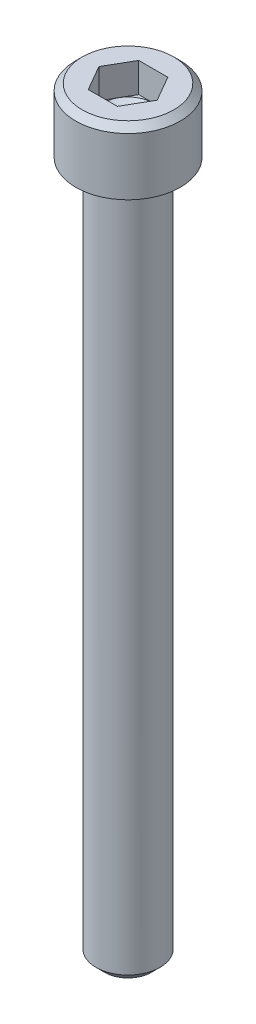
ISO-10303-21;
HEADER;
FILE_DESCRIPTION(('STEP AP214'),'2;1');
FILE_NAME('part.step','',(''),(''),'','','');
FILE_SCHEMA(('AUTOMOTIVE_DESIGN { 1 0 10303 214 1 1 1 1 }'));
ENDSEC;
DATA;
#1=APPLICATION_CONTEXT('core data for automotive mechanical design processes');
#2=APPLICATION_PROTOCOL_DEFINITION('international standard','automotive_design',2000,#1);
#3=PRODUCT_CONTEXT('',#1,'mechanical');
#4=PRODUCT('Part','Part','',(#3));
#5=PRODUCT_RELATED_PRODUCT_CATEGORY('part','',(#4));
#6=PRODUCT_DEFINITION_FORMATION('','',#4);
#7=PRODUCT_DEFINITION_CONTEXT('part definition',#1,'design');
#8=PRODUCT_DEFINITION('design','',#6,#7);
#9=PRODUCT_DEFINITION_SHAPE('','',#8);
#10=(LENGTH_UNIT() NAMED_UNIT(*) SI_UNIT(.MILLI.,.METRE.));
#11=(NAMED_UNIT(*) PLANE_ANGLE_UNIT() SI_UNIT($,.RADIAN.));
#12=(NAMED_UNIT(*) SI_UNIT($,.STERADIAN.) SOLID_ANGLE_UNIT());
#13=UNCERTAINTY_MEASURE_WITH_UNIT(LENGTH_MEASURE(1.E-05),#10,'distance_accuracy_value','');
#14=(GEOMETRIC_REPRESENTATION_CONTEXT(3) GLOBAL_UNCERTAINTY_ASSIGNED_CONTEXT((#13)) GLOBAL_UNIT_ASSIGNED_CONTEXT((#10,
#11,#12)) REPRESENTATION_CONTEXT('',''));
#15=CARTESIAN_POINT('',(0.,0.,0.));
#16=DIRECTION('',(0.,0.,1.));
#17=DIRECTION('',(1.,0.,0.));
#18=AXIS2_PLACEMENT_3D('',#15,#16,#17);
#19=CARTESIAN_POINT('',(0.,1.87959999988152,0.));
#20=DIRECTION('',(0.,1.,0.));
#21=DIRECTION('',(0.,0.,1.));
#22=AXIS2_PLACEMENT_3D('',#19,#20,#21);
#23=CONICAL_SURFACE('',#22,1.38429999981327,1.04719755105418);
#24=CARTESIAN_POINT('',(0.,1.08037402230821,-1.70530256582424E-10));
#25=VERTEX_POINT('',#24);
#26=VERTEX_LOOP('',#25);
#27=FACE_BOUND('',#26,.T.);
#28=CARTESIAN_POINT('',(0.,1.87959999997998,0.));
#29=DIRECTION('',(0.,1.,0.));
#30=DIRECTION('',(0.,0.,1.));
#31=AXIS2_PLACEMENT_3D('',#28,#29,#30);
#32=CIRCLE('',#31,1.3842999999838);
#33=CARTESIAN_POINT('',(-1.19883896645178,1.87959999998999,-0.692149999995953));
#34=VERTEX_POINT('',#33);
#35=CARTESIAN_POINT('',(0.,1.87959999998999,-1.3842999999919));
#36=VERTEX_POINT('',#35);
#37=EDGE_CURVE('E150',#34,#36,#32,.F.);
#38=ORIENTED_EDGE('',*,*,#37,.F.);
#39=CARTESIAN_POINT('',(0.,1.87959999997998,0.));
#40=DIRECTION('',(0.,1.,0.));
#41=DIRECTION('',(0.,0.,1.));
#42=AXIS2_PLACEMENT_3D('',#39,#40,#41);
#43=CIRCLE('',#42,1.3842999999838);
#44=CARTESIAN_POINT('',(-1.19883896645178,1.87959999998999,0.692149999995946));
#45=VERTEX_POINT('',#44);
#46=EDGE_CURVE('E97',#45,#34,#43,.F.);
#47=ORIENTED_EDGE('',*,*,#46,.F.);
#48=CARTESIAN_POINT('',(0.,1.87959999997998,0.));
#49=DIRECTION('',(0.,1.,0.));
#50=DIRECTION('',(0.,0.,1.));
#51=AXIS2_PLACEMENT_3D('',#48,#49,#50);
#52=CIRCLE('',#51,1.3842999999838);
#53=CARTESIAN_POINT('',(0.,1.87959999998999,1.3842999999919));
#54=VERTEX_POINT('',#53);
#55=EDGE_CURVE('E93',#54,#45,#52,.F.);
#56=ORIENTED_EDGE('',*,*,#55,.F.);
#57=CARTESIAN_POINT('',(0.,1.87959999997998,0.));
#58=DIRECTION('',(0.,1.,0.));
#59=DIRECTION('',(0.,0.,1.));
#60=AXIS2_PLACEMENT_3D('',#57,#58,#59);
#61=CIRCLE('',#60,1.3842999999838);
#62=CARTESIAN_POINT('',(1.19883896645178,1.87959999998999,0.692149999995948));
#63=VERTEX_POINT('',#62);
#64=EDGE_CURVE('E91',#63,#54,#61,.F.);
#65=ORIENTED_EDGE('',*,*,#64,.F.);
#66=CARTESIAN_POINT('',(0.,1.87959999997998,0.));
#67=DIRECTION('',(0.,1.,0.));
#68=DIRECTION('',(0.,0.,1.));
#69=AXIS2_PLACEMENT_3D('',#66,#67,#68);
#70=CIRCLE('',#69,1.3842999999838);
#71=CARTESIAN_POINT('',(1.19883896645178,1.87959999998999,-0.692149999995947));
#72=VERTEX_POINT('',#71);
#73=EDGE_CURVE('E21',#72,#63,#70,.F.);
#74=ORIENTED_EDGE('',*,*,#73,.F.);
#75=CARTESIAN_POINT('',(0.,1.87959999997998,0.));
#76=DIRECTION('',(0.,1.,0.));
#77=DIRECTION('',(0.,0.,1.));
#78=AXIS2_PLACEMENT_3D('',#75,#76,#77);
#79=CIRCLE('',#78,1.3842999999838);
#80=EDGE_CURVE('E108',#36,#72,#79,.F.);
#81=ORIENTED_EDGE('',*,*,#80,.F.);
#82=EDGE_LOOP('',(#38,#47,#56,#65,#74,#81));
#83=FACE_BOUND('',#82,.T.);
#84=ADVANCED_FACE('F18',(#27,#83),#23,.F.);
#85=CARTESIAN_POINT('',(0.,1.8796,0.));
#86=DIRECTION('',(0.,1.,0.));
#87=DIRECTION('',(0.,0.,1.));
#88=AXIS2_PLACEMENT_3D('',#85,#86,#87);
#89=PLANE('',#88);
#90=DIRECTION('',(0.500000000000001,0.,-0.866025403784438));
#91=VECTOR('',#90,1.);
#92=CARTESIAN_POINT('',(0.799225977639198,1.8796,1.3843));
#93=LINE('',#92,#91);
#94=CARTESIAN_POINT('',(1.5984519552784,1.8796,0.));
#95=VERTEX_POINT('',#94);
#96=EDGE_CURVE('E103',#63,#95,#93,.T.);
#97=ORIENTED_EDGE('',*,*,#96,.T.);
#98=DIRECTION('',(-0.499999999999999,0.,-0.866025403784439));
#99=VECTOR('',#98,1.);
#100=CARTESIAN_POINT('',(1.5984519552784,1.8796,0.));
#101=LINE('',#100,#99);
#102=EDGE_CURVE('E106',#95,#72,#101,.T.);
#103=ORIENTED_EDGE('',*,*,#102,.T.);
#104=ORIENTED_EDGE('',*,*,#73,.T.);
#105=EDGE_LOOP('',(#97,#103,#104));
#106=FACE_BOUND('',#105,.T.);
#107=ADVANCED_FACE('F101',(#106),#89,.T.);
#108=CARTESIAN_POINT('',(0.,1.8796,0.));
#109=DIRECTION('',(0.,1.,0.));
#110=DIRECTION('',(0.,0.,1.));
#111=AXIS2_PLACEMENT_3D('',#108,#109,#110);
#112=PLANE('',#111);
#113=DIRECTION('',(-0.499999999999999,0.,-0.866025403784439));
#114=VECTOR('',#113,1.);
#115=CARTESIAN_POINT('',(1.5984519552784,1.8796,0.));
#116=LINE('',#115,#114);
#117=CARTESIAN_POINT('',(0.799225977639201,1.8796,-1.3843));
#118=VERTEX_POINT('',#117);
#119=EDGE_CURVE('E117',#72,#118,#116,.T.);
#120=ORIENTED_EDGE('',*,*,#119,.T.);
#121=DIRECTION('',(-1.,0.,0.));
#122=VECTOR('',#121,1.);
#123=CARTESIAN_POINT('',(0.799225977639201,1.8796,-1.3843));
#124=LINE('',#123,#122);
#125=EDGE_CURVE('E157',#118,#36,#124,.T.);
#126=ORIENTED_EDGE('',*,*,#125,.T.);
#127=ORIENTED_EDGE('',*,*,#80,.T.);
#128=EDGE_LOOP('',(#120,#126,#127));
#129=FACE_BOUND('',#128,.T.);
#130=ADVANCED_FACE('F154',(#129),#112,.T.);
#131=CARTESIAN_POINT('',(0.,1.8796,0.));
#132=DIRECTION('',(0.,1.,0.));
#133=DIRECTION('',(0.,0.,1.));
#134=AXIS2_PLACEMENT_3D('',#131,#132,#133);
#135=PLANE('',#134);
#136=DIRECTION('',(-1.,0.,0.));
#137=VECTOR('',#136,1.);
#138=CARTESIAN_POINT('',(0.799225977639201,1.8796,-1.3843));
#139=LINE('',#138,#137);
#140=CARTESIAN_POINT('',(-0.799225977639195,1.8796,-1.3843));
#141=VERTEX_POINT('',#140);
#142=EDGE_CURVE('E162',#36,#141,#139,.T.);
#143=ORIENTED_EDGE('',*,*,#142,.T.);
#144=DIRECTION('',(-0.5,0.,0.866025403784438));
#145=VECTOR('',#144,1.);
#146=CARTESIAN_POINT('',(-0.799225977639195,1.8796,-1.3843));
#147=LINE('',#146,#145);
#148=EDGE_CURVE('E165',#141,#34,#147,.T.);
#149=ORIENTED_EDGE('',*,*,#148,.T.);
#150=ORIENTED_EDGE('',*,*,#37,.T.);
#151=EDGE_LOOP('',(#143,#149,#150));
#152=FACE_BOUND('',#151,.T.);
#153=ADVANCED_FACE('F161',(#152),#135,.T.);
#154=CARTESIAN_POINT('',(0.,1.8796,0.));
#155=DIRECTION('',(0.,1.,0.));
#156=DIRECTION('',(0.,0.,1.));
#157=AXIS2_PLACEMENT_3D('',#154,#155,#156);
#158=PLANE('',#157);
#159=DIRECTION('',(-0.5,0.,0.866025403784438));
#160=VECTOR('',#159,1.);
#161=CARTESIAN_POINT('',(-0.799225977639195,1.8796,-1.3843));
#162=LINE('',#161,#160);
#163=CARTESIAN_POINT('',(-1.5984519552784,1.8796,0.));
#164=VERTEX_POINT('',#163);
#165=EDGE_CURVE('E173',#34,#164,#162,.T.);
#166=ORIENTED_EDGE('',*,*,#165,.T.);
#167=DIRECTION('',(0.5,0.,0.866025403784439));
#168=VECTOR('',#167,1.);
#169=CARTESIAN_POINT('',(-1.5984519552784,1.8796,0.));
#170=LINE('',#169,#168);
#171=EDGE_CURVE('E232',#164,#45,#170,.T.);
#172=ORIENTED_EDGE('',*,*,#171,.T.);
#173=ORIENTED_EDGE('',*,*,#46,.T.);
#174=EDGE_LOOP('',(#166,#172,#173));
#175=FACE_BOUND('',#174,.T.);
#176=ADVANCED_FACE('F337',(#175),#158,.T.);
#177=CARTESIAN_POINT('',(0.,1.8796,0.));
#178=DIRECTION('',(0.,1.,0.));
#179=DIRECTION('',(0.,0.,1.));
#180=AXIS2_PLACEMENT_3D('',#177,#178,#179);
#181=PLANE('',#180);
#182=DIRECTION('',(1.,0.,0.));
#183=VECTOR('',#182,1.);
#184=CARTESIAN_POINT('',(-0.799225977639198,1.8796,1.3843));
#185=LINE('',#184,#183);
#186=CARTESIAN_POINT('',(0.799225977639198,1.8796,1.3843));
#187=VERTEX_POINT('',#186);
#188=EDGE_CURVE('E113',#54,#187,#185,.T.);
#189=ORIENTED_EDGE('',*,*,#188,.T.);
#190=DIRECTION('',(0.500000000000001,0.,-0.866025403784438));
#191=VECTOR('',#190,1.);
#192=CARTESIAN_POINT('',(0.799225977639198,1.8796,1.3843));
#193=LINE('',#192,#191);
#194=EDGE_CURVE('E110',#187,#63,#193,.T.);
#195=ORIENTED_EDGE('',*,*,#194,.T.);
#196=ORIENTED_EDGE('',*,*,#64,.T.);
#197=EDGE_LOOP('',(#189,#195,#196));
#198=FACE_BOUND('',#197,.T.);
#199=ADVANCED_FACE('F111',(#198),#181,.T.);
#200=CARTESIAN_POINT('',(0.,1.8796,0.));
#201=DIRECTION('',(0.,1.,0.));
#202=DIRECTION('',(0.,0.,1.));
#203=AXIS2_PLACEMENT_3D('',#200,#201,#202);
#204=PLANE('',#203);
#205=DIRECTION('',(0.5,0.,0.866025403784439));
#206=VECTOR('',#205,1.);
#207=CARTESIAN_POINT('',(-1.5984519552784,1.8796,0.));
#208=LINE('',#207,#206);
#209=CARTESIAN_POINT('',(-0.799225977639199,1.8796,1.3843));
#210=VERTEX_POINT('',#209);
#211=EDGE_CURVE('E169',#45,#210,#208,.T.);
#212=ORIENTED_EDGE('',*,*,#211,.T.);
#213=DIRECTION('',(1.,0.,0.));
#214=VECTOR('',#213,1.);
#215=CARTESIAN_POINT('',(-0.799225977639198,1.8796,1.3843));
#216=LINE('',#215,#214);
#217=EDGE_CURVE('E133',#210,#54,#216,.T.);
#218=ORIENTED_EDGE('',*,*,#217,.T.);
#219=ORIENTED_EDGE('',*,*,#55,.T.);
#220=EDGE_LOOP('',(#212,#218,#219));
#221=FACE_BOUND('',#220,.T.);
#222=ADVANCED_FACE('F331',(#221),#204,.T.);
#223=CARTESIAN_POINT('',(0.799225977639198,3.5052,1.3843));
#224=DIRECTION('',(0.866025403784438,0.,0.500000000000001));
#225=DIRECTION('',(0.500000000000001,0.,-0.866025403784438));
#226=AXIS2_PLACEMENT_3D('',#223,#224,#225);
#227=PLANE('',#226);
#228=DIRECTION('',(0.,1.,0.));
#229=VECTOR('',#228,1.);
#230=CARTESIAN_POINT('',(0.799225977639198,3.5052,1.3843));
#231=LINE('',#230,#229);
#232=CARTESIAN_POINT('',(0.799225977639198,3.5052,1.3843));
#233=VERTEX_POINT('',#232);
#234=EDGE_CURVE('E240',#187,#233,#231,.T.);
#235=ORIENTED_EDGE('',*,*,#234,.T.);
#236=DIRECTION('',(0.500000000000002,0.,-0.866025403784437));
#237=VECTOR('',#236,1.);
#238=CARTESIAN_POINT('',(0.799225977639198,3.5052,1.3843));
#239=LINE('',#238,#237);
#240=CARTESIAN_POINT('',(1.5984519552784,3.5052,0.));
#241=VERTEX_POINT('',#240);
#242=EDGE_CURVE('E130',#233,#241,#239,.T.);
#243=ORIENTED_EDGE('',*,*,#242,.T.);
#244=DIRECTION('',(0.,1.,0.));
#245=VECTOR('',#244,1.);
#246=CARTESIAN_POINT('',(1.5984519552784,3.5052,0.));
#247=LINE('',#246,#245);
#248=EDGE_CURVE('E121',#241,#95,#247,.F.);
#249=ORIENTED_EDGE('',*,*,#248,.T.);
#250=ORIENTED_EDGE('',*,*,#96,.F.);
#251=ORIENTED_EDGE('',*,*,#194,.F.);
#252=EDGE_LOOP('',(#235,#243,#249,#250,#251));
#253=FACE_BOUND('',#252,.T.);
#254=ADVANCED_FACE('F119',(#253),#227,.F.);
#255=CARTESIAN_POINT('',(1.5984519552784,3.5052,0.));
#256=DIRECTION('',(0.866025403784439,0.,-0.499999999999999));
#257=DIRECTION('',(-0.499999999999999,0.,-0.866025403784439));
#258=AXIS2_PLACEMENT_3D('',#255,#256,#257);
#259=PLANE('',#258);
#260=ORIENTED_EDGE('',*,*,#248,.F.);
#261=DIRECTION('',(-0.5,0.,-0.866025403784439));
#262=VECTOR('',#261,1.);
#263=CARTESIAN_POINT('',(1.5984519552784,3.5052,0.));
#264=LINE('',#263,#262);
#265=CARTESIAN_POINT('',(0.799225977639201,3.5052,-1.3843));
#266=VERTEX_POINT('',#265);
#267=EDGE_CURVE('E132',#241,#266,#264,.T.);
#268=ORIENTED_EDGE('',*,*,#267,.T.);
#269=DIRECTION('',(0.,1.,0.));
#270=VECTOR('',#269,1.);
#271=CARTESIAN_POINT('',(0.799225977639201,3.5052,-1.3843));
#272=LINE('',#271,#270);
#273=EDGE_CURVE('E181',#266,#118,#272,.F.);
#274=ORIENTED_EDGE('',*,*,#273,.T.);
#275=ORIENTED_EDGE('',*,*,#119,.F.);
#276=ORIENTED_EDGE('',*,*,#102,.F.);
#277=EDGE_LOOP('',(#260,#268,#274,#275,#276));
#278=FACE_BOUND('',#277,.T.);
#279=ADVANCED_FACE('F220',(#278),#259,.F.);
#280=CARTESIAN_POINT('',(0.799225977639201,3.5052,-1.3843));
#281=DIRECTION('',(0.,0.,-1.));
#282=DIRECTION('',(-1.,0.,0.));
#283=AXIS2_PLACEMENT_3D('',#280,#281,#282);
#284=PLANE('',#283);
#285=ORIENTED_EDGE('',*,*,#273,.F.);
#286=DIRECTION('',(1.,0.,0.));
#287=VECTOR('',#286,1.);
#288=CARTESIAN_POINT('',(0.,3.5052,-1.3843));
#289=LINE('',#288,#287);
#290=CARTESIAN_POINT('',(-0.799225977639195,3.5052,-1.3843));
#291=VERTEX_POINT('',#290);
#292=EDGE_CURVE('E191',#266,#291,#289,.F.);
#293=ORIENTED_EDGE('',*,*,#292,.T.);
#294=DIRECTION('',(0.,1.,0.));
#295=VECTOR('',#294,1.);
#296=CARTESIAN_POINT('',(-0.799225977639195,3.5052,-1.3843));
#297=LINE('',#296,#295);
#298=EDGE_CURVE('E170',#291,#141,#297,.F.);
#299=ORIENTED_EDGE('',*,*,#298,.T.);
#300=ORIENTED_EDGE('',*,*,#142,.F.);
#301=ORIENTED_EDGE('',*,*,#125,.F.);
#302=EDGE_LOOP('',(#285,#293,#299,#300,#301));
#303=FACE_BOUND('',#302,.T.);
#304=ADVANCED_FACE('F225',(#303),#284,.F.);
#305=CARTESIAN_POINT('',(-0.799225977639195,3.5052,-1.3843));
#306=DIRECTION('',(-0.866025403784438,0.,-0.5));
#307=DIRECTION('',(-0.5,0.,0.866025403784438));
#308=AXIS2_PLACEMENT_3D('',#305,#306,#307);
#309=PLANE('',#308);
#310=ORIENTED_EDGE('',*,*,#298,.F.);
#311=DIRECTION('',(-0.500000000000003,0.,0.866025403784437));
#312=VECTOR('',#311,1.);
#313=CARTESIAN_POINT('',(-0.799225977639195,3.5052,-1.3843));
#314=LINE('',#313,#312);
#315=CARTESIAN_POINT('',(-1.5984519552784,3.5052,0.));
#316=VERTEX_POINT('',#315);
#317=EDGE_CURVE('E189',#291,#316,#314,.T.);
#318=ORIENTED_EDGE('',*,*,#317,.T.);
#319=DIRECTION('',(0.,1.,0.));
#320=VECTOR('',#319,1.);
#321=CARTESIAN_POINT('',(-1.5984519552784,3.5052,0.));
#322=LINE('',#321,#320);
#323=EDGE_CURVE('E175',#316,#164,#322,.F.);
#324=ORIENTED_EDGE('',*,*,#323,.T.);
#325=ORIENTED_EDGE('',*,*,#165,.F.);
#326=ORIENTED_EDGE('',*,*,#148,.F.);
#327=EDGE_LOOP('',(#310,#318,#324,#325,#326));
#328=FACE_BOUND('',#327,.T.);
#329=ADVANCED_FACE('F174',(#328),#309,.F.);
#330=CARTESIAN_POINT('',(-1.5984519552784,3.5052,0.));
#331=DIRECTION('',(-0.866025403784439,0.,0.5));
#332=DIRECTION('',(0.5,0.,0.866025403784439));
#333=AXIS2_PLACEMENT_3D('',#330,#331,#332);
#334=PLANE('',#333);
#335=ORIENTED_EDGE('',*,*,#323,.F.);
#336=DIRECTION('',(0.500000000000001,0.,0.866025403784438));
#337=VECTOR('',#336,1.);
#338=CARTESIAN_POINT('',(-1.5984519552784,3.5052,0.));
#339=LINE('',#338,#337);
#340=CARTESIAN_POINT('',(-0.799225977639198,3.5052,1.3843));
#341=VERTEX_POINT('',#340);
#342=EDGE_CURVE('E36',#316,#341,#339,.T.);
#343=ORIENTED_EDGE('',*,*,#342,.T.);
#344=DIRECTION('',(0.,1.,0.));
#345=VECTOR('',#344,1.);
#346=CARTESIAN_POINT('',(-0.799225977639198,3.5052,1.3843));
#347=LINE('',#346,#345);
#348=EDGE_CURVE('E242',#341,#210,#347,.F.);
#349=ORIENTED_EDGE('',*,*,#348,.T.);
#350=ORIENTED_EDGE('',*,*,#211,.F.);
#351=ORIENTED_EDGE('',*,*,#171,.F.);
#352=EDGE_LOOP('',(#335,#343,#349,#350,#351));
#353=FACE_BOUND('',#352,.T.);
#354=ADVANCED_FACE('F230',(#353),#334,.F.);
#355=CARTESIAN_POINT('',(-0.799225977639198,3.5052,1.3843));
#356=DIRECTION('',(0.,0.,1.));
#357=DIRECTION('',(1.,0.,0.));
#358=AXIS2_PLACEMENT_3D('',#355,#356,#357);
#359=PLANE('',#358);
#360=ORIENTED_EDGE('',*,*,#348,.F.);
#361=DIRECTION('',(1.,0.,0.));
#362=VECTOR('',#361,1.);
#363=CARTESIAN_POINT('',(0.,3.5052,1.3843));
#364=LINE('',#363,#362);
#365=EDGE_CURVE('E146',#341,#233,#364,.T.);
#366=ORIENTED_EDGE('',*,*,#365,.T.);
#367=ORIENTED_EDGE('',*,*,#234,.F.);
#368=ORIENTED_EDGE('',*,*,#188,.F.);
#369=ORIENTED_EDGE('',*,*,#217,.F.);
#370=EDGE_LOOP('',(#360,#366,#367,#368,#369));
#371=FACE_BOUND('',#370,.T.);
#372=ADVANCED_FACE('F317',(#371),#359,.F.);
#373=CARTESIAN_POINT('',(0.,3.5052,0.));
#374=DIRECTION('',(0.,-1.,0.));
#375=DIRECTION('',(0.,0.,-1.));
#376=AXIS2_PLACEMENT_3D('',#373,#374,#375);
#377=PLANE('',#376);
#378=ORIENTED_EDGE('',*,*,#342,.F.);
#379=ORIENTED_EDGE('',*,*,#317,.F.);
#380=ORIENTED_EDGE('',*,*,#292,.F.);
#381=ORIENTED_EDGE('',*,*,#267,.F.);
#382=ORIENTED_EDGE('',*,*,#242,.F.);
#383=ORIENTED_EDGE('',*,*,#365,.F.);
#384=EDGE_LOOP('',(#378,#379,#380,#381,#382,#383));
#385=FACE_BOUND('',#384,.T.);
#386=CARTESIAN_POINT('',(0.,3.50519999994958,0.));
#387=DIRECTION('',(0.,-1.,0.));
#388=DIRECTION('',(0.,0.,-1.));
#389=AXIS2_PLACEMENT_3D('',#386,#387,#388);
#390=CIRCLE('',#389,2.51460000004045);
#391=CARTESIAN_POINT('',(0.,3.50519999994958,-2.51460000004045));
#392=VERTEX_POINT('',#391);
#393=EDGE_CURVE('E144',#392,#392,#390,.T.);
#394=ORIENTED_EDGE('',*,*,#393,.F.);
#395=EDGE_LOOP('',(#394));
#396=FACE_BOUND('',#395,.T.);
#397=ADVANCED_FACE('F227',(#385,#396),#377,.F.);
#398=CARTESIAN_POINT('',(0.,3.14960000002884,0.));
#399=DIRECTION('',(0.,-1.,0.));
#400=DIRECTION('',(0.,0.,-1.));
#401=AXIS2_PLACEMENT_3D('',#398,#399,#400);
#402=CONICAL_SURFACE('',#401,2.87020000001803,0.785398163477374);
#403=CARTESIAN_POINT('',(0.,3.1496,0.));
#404=DIRECTION('',(0.,-1.,0.));
#405=DIRECTION('',(0.,0.,-1.));
#406=AXIS2_PLACEMENT_3D('',#403,#404,#405);
#407=CIRCLE('',#406,2.8702);
#408=CARTESIAN_POINT('',(0.,3.1496,-2.8702));
#409=VERTEX_POINT('',#408);
#410=EDGE_CURVE('E143',#409,#409,#407,.T.);
#411=ORIENTED_EDGE('',*,*,#410,.F.);
#412=EDGE_LOOP('',(#411));
#413=FACE_BOUND('',#412,.T.);
#414=ORIENTED_EDGE('',*,*,#393,.T.);
#415=EDGE_LOOP('',(#414));
#416=FACE_BOUND('',#415,.T.);
#417=ADVANCED_FACE('F310',(#413,#416),#402,.T.);
#418=CARTESIAN_POINT('',(0.,5.58546,0.));
#419=DIRECTION('',(0.,-1.,0.));
#420=DIRECTION('',(0.,0.,-1.));
#421=AXIS2_PLACEMENT_3D('',#418,#419,#420);
#422=CYLINDRICAL_SURFACE('',#421,2.8702);
#423=CARTESIAN_POINT('',(0.,0.,0.));
#424=DIRECTION('',(0.,-1.,0.));
#425=DIRECTION('',(0.,0.,-1.));
#426=AXIS2_PLACEMENT_3D('',#423,#424,#425);
#427=CIRCLE('',#426,2.8702);
#428=CARTESIAN_POINT('',(0.,0.,-2.8702));
#429=VERTEX_POINT('',#428);
#430=EDGE_CURVE('E140',#429,#429,#427,.T.);
#431=ORIENTED_EDGE('',*,*,#430,.F.);
#432=EDGE_LOOP('',(#431));
#433=FACE_BOUND('',#432,.T.);
#434=ORIENTED_EDGE('',*,*,#410,.T.);
#435=EDGE_LOOP('',(#434));
#436=FACE_BOUND('',#435,.T.);
#437=ADVANCED_FACE('F307',(#433,#436),#422,.T.);
#438=CARTESIAN_POINT('',(0.,0.,0.));
#439=DIRECTION('',(0.,-1.,0.));
#440=DIRECTION('',(0.,0.,-1.));
#441=AXIS2_PLACEMENT_3D('',#438,#439,#440);
#442=PLANE('',#441);
#443=CARTESIAN_POINT('',(0.,0.,0.));
#444=DIRECTION('',(0.,-1.,0.));
#445=DIRECTION('',(-1.,0.,-3.20523991131182E-11));
#446=AXIS2_PLACEMENT_3D('',#443,#444,#445);
#447=CIRCLE('',#446,2.0066);
#448=CARTESIAN_POINT('',(-2.0066,0.,-6.43163440603831E-11));
#449=VERTEX_POINT('',#448);
#450=EDGE_CURVE('E139',#449,#449,#447,.F.);
#451=ORIENTED_EDGE('',*,*,#450,.T.);
#452=EDGE_LOOP('',(#451));
#453=FACE_BOUND('',#452,.T.);
#454=ORIENTED_EDGE('',*,*,#430,.T.);
#455=EDGE_LOOP('',(#454));
#456=FACE_BOUND('',#455,.T.);
#457=ADVANCED_FACE('F298',(#453,#456),#442,.T.);
#458=CARTESIAN_POINT('',(0.,-38.1,0.));
#459=DIRECTION('',(0.,-1.,0.));
#460=DIRECTION('',(0.,0.,-1.));
#461=AXIS2_PLACEMENT_3D('',#458,#459,#460);
#462=PLANE('',#461);
#463=CARTESIAN_POINT('',(0.,-38.0999999999858,0.));
#464=DIRECTION('',(0.,1.,0.));
#465=DIRECTION('',(0.,0.,1.));
#466=AXIS2_PLACEMENT_3D('',#463,#464,#465);
#467=CIRCLE('',#466,1.28016000002162);
#468=CARTESIAN_POINT('',(0.,-38.0999999999858,1.28016000002162));
#469=VERTEX_POINT('',#468);
#470=EDGE_CURVE('E136',#469,#469,#467,.T.);
#471=ORIENTED_EDGE('',*,*,#470,.F.);
#472=EDGE_LOOP('',(#471));
#473=FACE_BOUND('',#472,.T.);
#474=ADVANCED_FACE('F285',(#473),#462,.T.);
#475=CARTESIAN_POINT('',(0.,-0.254,0.));
#476=DIRECTION('',(0.,-1.,0.));
#477=DIRECTION('',(0.,0.,-1.));
#478=AXIS2_PLACEMENT_3D('',#475,#476,#477);
#479=TOROIDAL_SURFACE('',#478,2.0066,0.254);
#480=CARTESIAN_POINT('',(0.,-0.254,0.));
#481=DIRECTION('',(0.,-1.,0.));
#482=DIRECTION('',(0.,0.,-1.));
#483=AXIS2_PLACEMENT_3D('',#480,#481,#482);
#484=CIRCLE('',#483,1.7526);
#485=CARTESIAN_POINT('',(0.,-0.254,-1.7526));
#486=VERTEX_POINT('',#485);
#487=EDGE_CURVE('E27',#486,#486,#484,.T.);
#488=ORIENTED_EDGE('',*,*,#487,.F.);
#489=EDGE_LOOP('',(#488));
#490=FACE_BOUND('',#489,.T.);
#491=ORIENTED_EDGE('',*,*,#450,.F.);
#492=EDGE_LOOP('',(#491));
#493=FACE_BOUND('',#492,.T.);
#494=ADVANCED_FACE('F273',(#490,#493),#479,.F.);
#495=CARTESIAN_POINT('',(0.,-37.6275600000326,0.));
#496=DIRECTION('',(0.,1.,0.));
#497=DIRECTION('',(0.,0.,1.));
#498=AXIS2_PLACEMENT_3D('',#495,#496,#497);
#499=CONICAL_SURFACE('',#498,1.75259999997479,0.785398163397448);
#500=ORIENTED_EDGE('',*,*,#470,.T.);
#501=EDGE_LOOP('',(#500));
#502=FACE_BOUND('',#501,.T.);
#503=CARTESIAN_POINT('',(0.,-37.62756,0.));
#504=DIRECTION('',(0.,-1.,0.));
#505=DIRECTION('',(0.,0.,-1.));
#506=AXIS2_PLACEMENT_3D('',#503,#504,#505);
#507=CIRCLE('',#506,1.7526);
#508=CARTESIAN_POINT('',(0.,-37.62756,-1.7526));
#509=VERTEX_POINT('',#508);
#510=EDGE_CURVE('E11',#509,#509,#507,.F.);
#511=ORIENTED_EDGE('',*,*,#510,.F.);
#512=EDGE_LOOP('',(#511));
#513=FACE_BOUND('',#512,.T.);
#514=ADVANCED_FACE('F284',(#502,#513),#499,.T.);
#515=CARTESIAN_POINT('',(0.,5.58546,0.));
#516=DIRECTION('',(0.,-1.,0.));
#517=DIRECTION('',(0.,0.,-1.));
#518=AXIS2_PLACEMENT_3D('',#515,#516,#517);
#519=CYLINDRICAL_SURFACE('',#518,1.7526);
#520=ORIENTED_EDGE('',*,*,#510,.T.);
#521=EDGE_LOOP('',(#520));
#522=FACE_BOUND('',#521,.T.);
#523=ORIENTED_EDGE('',*,*,#487,.T.);
#524=EDGE_LOOP('',(#523));
#525=FACE_BOUND('',#524,.T.);
#526=ADVANCED_FACE('F349',(#522,#525),#519,.T.);
#527=CLOSED_SHELL('',(#84,#107,#130,#153,#176,#199,#222,#254,#279,#304,#329,#354,#372,#397,#417,
#437,#457,#474,#494,#514,#526));
#528=MANIFOLD_SOLID_BREP('B1',#527);
#529=ADVANCED_BREP_SHAPE_REPRESENTATION('',(#18,#528),#14);
#530=SHAPE_DEFINITION_REPRESENTATION(#9,#529);
ENDSEC;
END-ISO-10303-21;
